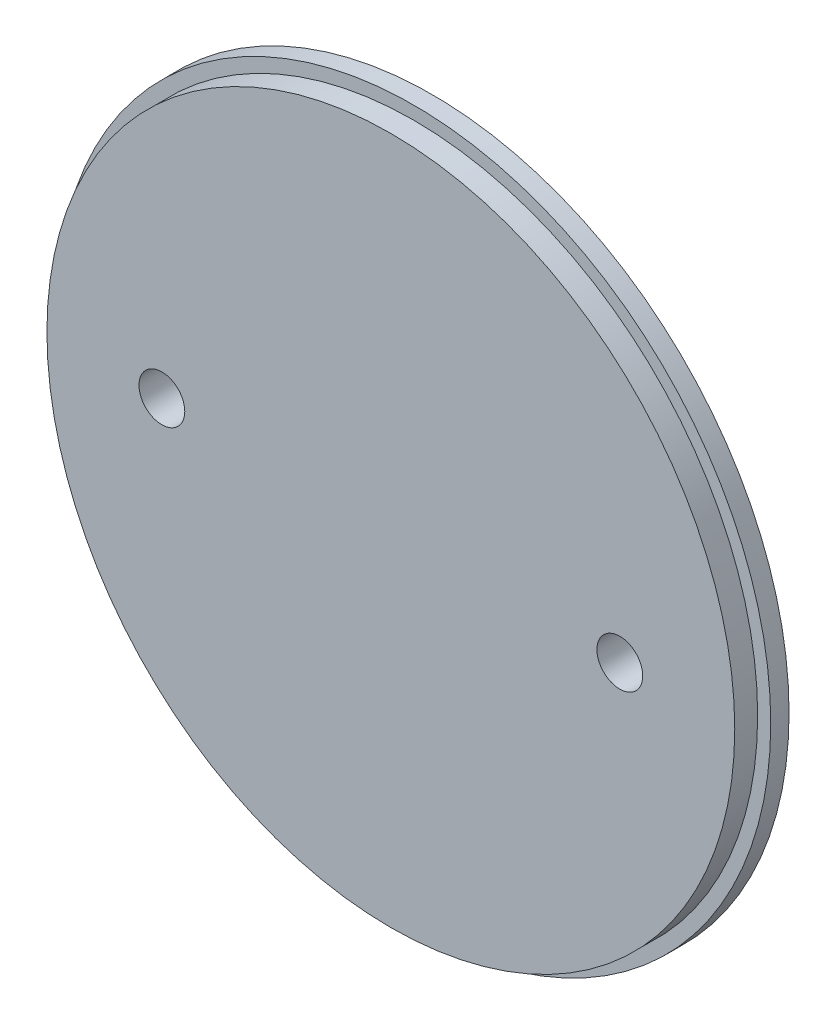
ISO-10303-21;
HEADER;
FILE_DESCRIPTION(('STEP AP214'),'2;1');
FILE_NAME('part.step','',(''),(''),'','','');
FILE_SCHEMA(('AUTOMOTIVE_DESIGN { 1 0 10303 214 1 1 1 1 }'));
ENDSEC;
DATA;
#1=APPLICATION_CONTEXT('core data for automotive mechanical design processes');
#2=APPLICATION_PROTOCOL_DEFINITION('international standard','automotive_design',2000,#1);
#3=PRODUCT_CONTEXT('',#1,'mechanical');
#4=PRODUCT('Part','Part','',(#3));
#5=PRODUCT_RELATED_PRODUCT_CATEGORY('part','',(#4));
#6=PRODUCT_DEFINITION_FORMATION('','',#4);
#7=PRODUCT_DEFINITION_CONTEXT('part definition',#1,'design');
#8=PRODUCT_DEFINITION('design','',#6,#7);
#9=PRODUCT_DEFINITION_SHAPE('','',#8);
#10=(LENGTH_UNIT() NAMED_UNIT(*) SI_UNIT(.MILLI.,.METRE.));
#11=(NAMED_UNIT(*) PLANE_ANGLE_UNIT() SI_UNIT($,.RADIAN.));
#12=(NAMED_UNIT(*) SI_UNIT($,.STERADIAN.) SOLID_ANGLE_UNIT());
#13=UNCERTAINTY_MEASURE_WITH_UNIT(LENGTH_MEASURE(1.E-05),#10,'distance_accuracy_value','');
#14=(GEOMETRIC_REPRESENTATION_CONTEXT(3) GLOBAL_UNCERTAINTY_ASSIGNED_CONTEXT((#13)) GLOBAL_UNIT_ASSIGNED_CONTEXT((#10,
#11,#12)) REPRESENTATION_CONTEXT('',''));
#15=CARTESIAN_POINT('',(0.,0.,0.));
#16=DIRECTION('',(0.,0.,1.));
#17=DIRECTION('',(1.,0.,0.));
#18=AXIS2_PLACEMENT_3D('',#15,#16,#17);
#19=CARTESIAN_POINT('',(0.,0.,2.54));
#20=DIRECTION('',(0.,0.,-1.));
#21=DIRECTION('',(-1.,0.,0.));
#22=AXIS2_PLACEMENT_3D('',#19,#20,#21);
#23=CYLINDRICAL_SURFACE('',#22,49.5046);
#24=CARTESIAN_POINT('',(0.,0.,2.54));
#25=DIRECTION('',(0.,0.,1.));
#26=DIRECTION('',(1.,0.,0.));
#27=AXIS2_PLACEMENT_3D('',#24,#25,#26);
#28=CIRCLE('',#27,49.5046);
#29=CARTESIAN_POINT('',(49.5046,0.,2.54));
#30=VERTEX_POINT('',#29);
#31=EDGE_CURVE('E39',#30,#30,#28,.T.);
#32=ORIENTED_EDGE('',*,*,#31,.F.);
#33=EDGE_LOOP('',(#32));
#34=FACE_BOUND('',#33,.T.);
#35=CARTESIAN_POINT('',(0.,0.,0.));
#36=DIRECTION('',(0.,0.,1.));
#37=DIRECTION('',(1.,0.,0.));
#38=AXIS2_PLACEMENT_3D('',#35,#36,#37);
#39=CIRCLE('',#38,49.5046);
#40=CARTESIAN_POINT('',(49.5046,0.,0.));
#41=VERTEX_POINT('',#40);
#42=EDGE_CURVE('E35',#41,#41,#39,.T.);
#43=ORIENTED_EDGE('',*,*,#42,.T.);
#44=EDGE_LOOP('',(#43));
#45=FACE_BOUND('',#44,.T.);
#46=ADVANCED_FACE('F32',(#34,#45),#23,.T.);
#47=CARTESIAN_POINT('',(0.,0.,2.54));
#48=DIRECTION('',(0.,0.,1.));
#49=DIRECTION('',(1.,0.,0.));
#50=AXIS2_PLACEMENT_3D('',#47,#48,#49);
#51=PLANE('',#50);
#52=CARTESIAN_POINT('',(0.,0.,2.54));
#53=DIRECTION('',(0.,0.,1.));
#54=DIRECTION('',(1.,0.,0.));
#55=AXIS2_PLACEMENT_3D('',#52,#53,#54);
#56=CIRCLE('',#55,47.6885);
#57=CARTESIAN_POINT('',(47.6885,0.,2.54));
#58=VERTEX_POINT('',#57);
#59=EDGE_CURVE('E10',#58,#58,#56,.T.);
#60=ORIENTED_EDGE('',*,*,#59,.F.);
#61=EDGE_LOOP('',(#60));
#62=FACE_BOUND('',#61,.T.);
#63=ORIENTED_EDGE('',*,*,#31,.T.);
#64=EDGE_LOOP('',(#63));
#65=FACE_BOUND('',#64,.T.);
#66=ADVANCED_FACE('F85',(#62,#65),#51,.T.);
#67=CARTESIAN_POINT('',(0.,0.,0.));
#68=DIRECTION('',(0.,0.,1.));
#69=DIRECTION('',(1.,0.,0.));
#70=AXIS2_PLACEMENT_3D('',#67,#68,#69);
#71=PLANE('',#70);
#72=CARTESIAN_POINT('',(-31.75,0.,0.));
#73=DIRECTION('',(0.,0.,1.));
#74=DIRECTION('',(1.,0.,0.));
#75=AXIS2_PLACEMENT_3D('',#72,#73,#74);
#76=CIRCLE('',#75,3.175);
#77=CARTESIAN_POINT('',(-28.575,0.,0.));
#78=VERTEX_POINT('',#77);
#79=EDGE_CURVE('E48',#78,#78,#76,.T.);
#80=ORIENTED_EDGE('',*,*,#79,.T.);
#81=EDGE_LOOP('',(#80));
#82=FACE_BOUND('',#81,.T.);
#83=CARTESIAN_POINT('',(31.75,0.,0.));
#84=DIRECTION('',(0.,0.,1.));
#85=DIRECTION('',(1.,0.,0.));
#86=AXIS2_PLACEMENT_3D('',#83,#84,#85);
#87=CIRCLE('',#86,3.175);
#88=CARTESIAN_POINT('',(34.925,0.,0.));
#89=VERTEX_POINT('',#88);
#90=EDGE_CURVE('E52',#89,#89,#87,.T.);
#91=ORIENTED_EDGE('',*,*,#90,.T.);
#92=EDGE_LOOP('',(#91));
#93=FACE_BOUND('',#92,.T.);
#94=ORIENTED_EDGE('',*,*,#42,.F.);
#95=EDGE_LOOP('',(#94));
#96=FACE_BOUND('',#95,.T.);
#97=ADVANCED_FACE('F61',(#82,#93,#96),#71,.F.);
#98=CARTESIAN_POINT('',(0.,0.,5.715));
#99=DIRECTION('',(0.,0.,-1.));
#100=DIRECTION('',(-1.,0.,0.));
#101=AXIS2_PLACEMENT_3D('',#98,#99,#100);
#102=CYLINDRICAL_SURFACE('',#101,47.6885);
#103=CARTESIAN_POINT('',(0.,0.,5.715));
#104=DIRECTION('',(0.,0.,1.));
#105=DIRECTION('',(1.,0.,0.));
#106=AXIS2_PLACEMENT_3D('',#103,#104,#105);
#107=CIRCLE('',#106,47.6885);
#108=CARTESIAN_POINT('',(47.6885,0.,5.715));
#109=VERTEX_POINT('',#108);
#110=EDGE_CURVE('E45',#109,#109,#107,.T.);
#111=ORIENTED_EDGE('',*,*,#110,.F.);
#112=EDGE_LOOP('',(#111));
#113=FACE_BOUND('',#112,.T.);
#114=ORIENTED_EDGE('',*,*,#59,.T.);
#115=EDGE_LOOP('',(#114));
#116=FACE_BOUND('',#115,.T.);
#117=ADVANCED_FACE('F74',(#113,#116),#102,.T.);
#118=CARTESIAN_POINT('',(0.,0.,5.715));
#119=DIRECTION('',(0.,0.,1.));
#120=DIRECTION('',(1.,0.,0.));
#121=AXIS2_PLACEMENT_3D('',#118,#119,#120);
#122=PLANE('',#121);
#123=CARTESIAN_POINT('',(-31.75,0.,5.715));
#124=DIRECTION('',(0.,0.,1.));
#125=DIRECTION('',(1.,0.,0.));
#126=AXIS2_PLACEMENT_3D('',#123,#124,#125);
#127=CIRCLE('',#126,3.175);
#128=CARTESIAN_POINT('',(-28.575,0.,5.715));
#129=VERTEX_POINT('',#128);
#130=EDGE_CURVE('E55',#129,#129,#127,.T.);
#131=ORIENTED_EDGE('',*,*,#130,.F.);
#132=EDGE_LOOP('',(#131));
#133=FACE_BOUND('',#132,.T.);
#134=CARTESIAN_POINT('',(31.75,0.,5.715));
#135=DIRECTION('',(0.,0.,1.));
#136=DIRECTION('',(1.,0.,0.));
#137=AXIS2_PLACEMENT_3D('',#134,#135,#136);
#138=CIRCLE('',#137,3.175);
#139=CARTESIAN_POINT('',(34.925,0.,5.715));
#140=VERTEX_POINT('',#139);
#141=EDGE_CURVE('E49',#140,#140,#138,.T.);
#142=ORIENTED_EDGE('',*,*,#141,.F.);
#143=EDGE_LOOP('',(#142));
#144=FACE_BOUND('',#143,.T.);
#145=ORIENTED_EDGE('',*,*,#110,.T.);
#146=EDGE_LOOP('',(#145));
#147=FACE_BOUND('',#146,.T.);
#148=ADVANCED_FACE('F71',(#133,#144,#147),#122,.T.);
#149=CARTESIAN_POINT('',(31.75,0.,0.));
#150=DIRECTION('',(0.,0.,1.));
#151=DIRECTION('',(1.,0.,0.));
#152=AXIS2_PLACEMENT_3D('',#149,#150,#151);
#153=CYLINDRICAL_SURFACE('',#152,3.175);
#154=ORIENTED_EDGE('',*,*,#90,.F.);
#155=EDGE_LOOP('',(#154));
#156=FACE_BOUND('',#155,.T.);
#157=ORIENTED_EDGE('',*,*,#141,.T.);
#158=EDGE_LOOP('',(#157));
#159=FACE_BOUND('',#158,.T.);
#160=ADVANCED_FACE('F67',(#156,#159),#153,.F.);
#161=CARTESIAN_POINT('',(-31.75,0.,0.));
#162=DIRECTION('',(0.,0.,1.));
#163=DIRECTION('',(1.,0.,0.));
#164=AXIS2_PLACEMENT_3D('',#161,#162,#163);
#165=CYLINDRICAL_SURFACE('',#164,3.175);
#166=ORIENTED_EDGE('',*,*,#79,.F.);
#167=EDGE_LOOP('',(#166));
#168=FACE_BOUND('',#167,.T.);
#169=ORIENTED_EDGE('',*,*,#130,.T.);
#170=EDGE_LOOP('',(#169));
#171=FACE_BOUND('',#170,.T.);
#172=ADVANCED_FACE('F64',(#168,#171),#165,.F.);
#173=CLOSED_SHELL('',(#46,#66,#97,#117,#148,#160,#172));
#174=MANIFOLD_SOLID_BREP('B2',#173);
#175=ADVANCED_BREP_SHAPE_REPRESENTATION('',(#18,#174),#14);
#176=SHAPE_DEFINITION_REPRESENTATION(#9,#175);
ENDSEC;
END-ISO-10303-21;
